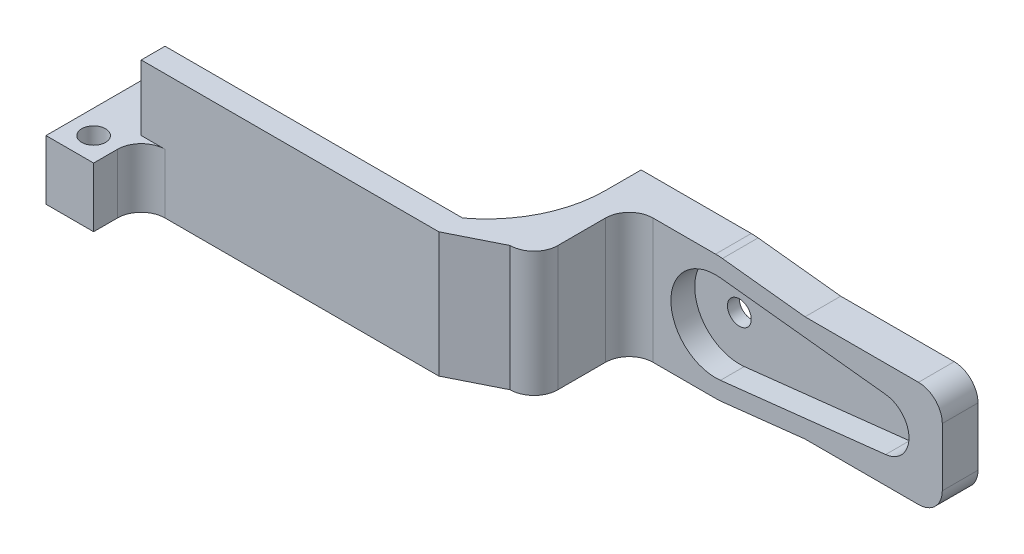
ISO-10303-21;
HEADER;
FILE_DESCRIPTION(('STEP AP214'),'2;1');
FILE_NAME('part.step','',(''),(''),'','','');
FILE_SCHEMA(('AUTOMOTIVE_DESIGN { 1 0 10303 214 1 1 1 1 }'));
ENDSEC;
DATA;
#1=APPLICATION_CONTEXT('core data for automotive mechanical design processes');
#2=APPLICATION_PROTOCOL_DEFINITION('international standard','automotive_design',2000,#1);
#3=PRODUCT_CONTEXT('',#1,'mechanical');
#4=PRODUCT('Part','Part','',(#3));
#5=PRODUCT_RELATED_PRODUCT_CATEGORY('part','',(#4));
#6=PRODUCT_DEFINITION_FORMATION('','',#4);
#7=PRODUCT_DEFINITION_CONTEXT('part definition',#1,'design');
#8=PRODUCT_DEFINITION('design','',#6,#7);
#9=PRODUCT_DEFINITION_SHAPE('','',#8);
#10=(LENGTH_UNIT() NAMED_UNIT(*) SI_UNIT(.MILLI.,.METRE.));
#11=(NAMED_UNIT(*) PLANE_ANGLE_UNIT() SI_UNIT($,.RADIAN.));
#12=(NAMED_UNIT(*) SI_UNIT($,.STERADIAN.) SOLID_ANGLE_UNIT());
#13=UNCERTAINTY_MEASURE_WITH_UNIT(LENGTH_MEASURE(1.E-05),#10,'distance_accuracy_value','');
#14=(GEOMETRIC_REPRESENTATION_CONTEXT(3) GLOBAL_UNCERTAINTY_ASSIGNED_CONTEXT((#13)) GLOBAL_UNIT_ASSIGNED_CONTEXT((#10,
#11,#12)) REPRESENTATION_CONTEXT('',''));
#15=CARTESIAN_POINT('',(0.,0.,0.));
#16=DIRECTION('',(0.,0.,1.));
#17=DIRECTION('',(1.,0.,0.));
#18=AXIS2_PLACEMENT_3D('',#15,#16,#17);
#19=CARTESIAN_POINT('',(-38.25,30.3298724079689,7.99999999999999));
#20=DIRECTION('',(-1.,0.,0.));
#21=DIRECTION('',(0.,0.,1.));
#22=AXIS2_PLACEMENT_3D('',#19,#20,#21);
#23=PLANE('',#22);
#24=DIRECTION('',(0.,-1.,0.));
#25=VECTOR('',#24,1.);
#26=CARTESIAN_POINT('',(-38.25,30.3298724079689,7.99999999999999));
#27=LINE('',#26,#25);
#28=CARTESIAN_POINT('',(-38.25,5.25,7.99999999999999));
#29=VERTEX_POINT('',#28);
#30=CARTESIAN_POINT('',(-38.25,-0.25,7.99999999999999));
#31=VERTEX_POINT('',#30);
#32=EDGE_CURVE('E309',#29,#31,#27,.T.);
#33=ORIENTED_EDGE('',*,*,#32,.T.);
#34=DIRECTION('',(0.,0.,1.));
#35=VECTOR('',#34,1.);
#36=CARTESIAN_POINT('',(-38.25,-0.25,14.));
#37=LINE('',#36,#35);
#38=CARTESIAN_POINT('',(-38.25,-0.25,9.99999999999999));
#39=VERTEX_POINT('',#38);
#40=EDGE_CURVE('E259',#31,#39,#37,.T.);
#41=ORIENTED_EDGE('',*,*,#40,.T.);
#42=DIRECTION('',(0.,-1.,0.));
#43=VECTOR('',#42,1.);
#44=CARTESIAN_POINT('',(-38.25,30.3298724079689,9.99999999999999));
#45=LINE('',#44,#43);
#46=CARTESIAN_POINT('',(-38.25,5.25,9.99999999999999));
#47=VERTEX_POINT('',#46);
#48=EDGE_CURVE('E305',#47,#39,#45,.T.);
#49=ORIENTED_EDGE('',*,*,#48,.F.);
#50=DIRECTION('',(0.,0.,-1.));
#51=VECTOR('',#50,1.);
#52=CARTESIAN_POINT('',(-38.25,5.25,7.99999999999999));
#53=LINE('',#52,#51);
#54=EDGE_CURVE('E310',#47,#29,#53,.T.);
#55=ORIENTED_EDGE('',*,*,#54,.T.);
#56=EDGE_LOOP('',(#33,#41,#49,#55));
#57=FACE_BOUND('',#56,.T.);
#58=ADVANCED_FACE('F35',(#57),#23,.T.);
#59=CARTESIAN_POINT('',(0.,0.,2.));
#60=DIRECTION('',(0.,0.,-1.));
#61=DIRECTION('',(-1.,0.,0.));
#62=AXIS2_PLACEMENT_3D('',#59,#60,#61);
#63=CYLINDRICAL_SURFACE('',#62,5.25);
#64=CARTESIAN_POINT('',(0.,0.,-3.));
#65=DIRECTION('',(0.,0.,1.));
#66=DIRECTION('',(1.,0.,0.));
#67=AXIS2_PLACEMENT_3D('',#64,#65,#66);
#68=CIRCLE('',#67,5.25);
#69=CARTESIAN_POINT('',(0.57918149466192,5.21795446475352,-3.));
#70=VERTEX_POINT('',#69);
#71=CARTESIAN_POINT('',(0.,5.25,-3.));
#72=VERTEX_POINT('',#71);
#73=EDGE_CURVE('E409',#70,#72,#68,.T.);
#74=ORIENTED_EDGE('',*,*,#73,.T.);
#75=DIRECTION('',(0.,0.,1.));
#76=VECTOR('',#75,1.);
#77=CARTESIAN_POINT('',(0.,5.25,-3.00000000000001));
#78=LINE('',#77,#76);
#79=CARTESIAN_POINT('',(0.,5.25,0.));
#80=VERTEX_POINT('',#79);
#81=EDGE_CURVE('E363',#72,#80,#78,.T.);
#82=ORIENTED_EDGE('',*,*,#81,.T.);
#83=CARTESIAN_POINT('',(0.,0.,0.));
#84=DIRECTION('',(0.,0.,-1.));
#85=DIRECTION('',(-1.,0.,0.));
#86=AXIS2_PLACEMENT_3D('',#83,#84,#85);
#87=CIRCLE('',#86,5.25);
#88=CARTESIAN_POINT('',(0.57918149466192,5.21795446475352,0.));
#89=VERTEX_POINT('',#88);
#90=EDGE_CURVE('E383',#80,#89,#87,.T.);
#91=ORIENTED_EDGE('',*,*,#90,.T.);
#92=DIRECTION('',(0.,0.,-1.));
#93=VECTOR('',#92,1.);
#94=CARTESIAN_POINT('',(0.57918149466192,5.21795446475352,2.));
#95=LINE('',#94,#93);
#96=EDGE_CURVE('E441',#89,#70,#95,.T.);
#97=ORIENTED_EDGE('',*,*,#96,.T.);
#98=EDGE_LOOP('',(#74,#82,#91,#97));
#99=FACE_BOUND('',#98,.T.);
#100=ADVANCED_FACE('F527',(#99),#63,.T.);
#101=CARTESIAN_POINT('',(14.4581850533808,3.67741552754058,2.));
#102=DIRECTION('',(-0.110320284697509,-0.99389608852448,0.));
#103=DIRECTION('',(0.99389608852448,-0.110320284697509,0.));
#104=AXIS2_PLACEMENT_3D('',#101,#102,#103);
#105=PLANE('',#104);
#106=DIRECTION('',(-0.99389608852448,0.110320284697509,0.));
#107=VECTOR('',#106,1.);
#108=CARTESIAN_POINT('',(14.4581850533808,3.67741552754058,0.));
#109=LINE('',#108,#107);
#110=CARTESIAN_POINT('',(7.51868327402135,4.44768499614705,0.));
#111=VERTEX_POINT('',#110);
#112=EDGE_CURVE('E370',#111,#89,#109,.T.);
#113=ORIENTED_EDGE('',*,*,#112,.F.);
#114=DIRECTION('',(0.,0.,-1.));
#115=VECTOR('',#114,1.);
#116=CARTESIAN_POINT('',(7.51868327402135,4.44768499614705,3.));
#117=LINE('',#116,#115);
#118=CARTESIAN_POINT('',(7.51868327402135,4.44768499614705,-3.));
#119=VERTEX_POINT('',#118);
#120=EDGE_CURVE('E427',#111,#119,#117,.T.);
#121=ORIENTED_EDGE('',*,*,#120,.T.);
#122=DIRECTION('',(-0.99389608852448,0.110320284697509,0.));
#123=VECTOR('',#122,1.);
#124=CARTESIAN_POINT('',(14.4581850533808,3.67741552754058,-3.));
#125=LINE('',#124,#123);
#126=EDGE_CURVE('E403',#119,#70,#125,.T.);
#127=ORIENTED_EDGE('',*,*,#126,.T.);
#128=ORIENTED_EDGE('',*,*,#96,.F.);
#129=EDGE_LOOP('',(#113,#121,#127,#128));
#130=FACE_BOUND('',#129,.T.);
#131=ADVANCED_FACE('F520',(#130),#105,.F.);
#132=CARTESIAN_POINT('',(0.579181494661921,-5.21795446475352,0.));
#133=VERTEX_POINT('',#132);
#134=CARTESIAN_POINT('',(0.,-5.25,0.));
#135=VERTEX_POINT('',#134);
#136=EDGE_CURVE('E384',#133,#135,#87,.T.);
#137=ORIENTED_EDGE('',*,*,#136,.T.);
#138=DIRECTION('',(0.,0.,1.));
#139=VECTOR('',#138,1.);
#140=CARTESIAN_POINT('',(0.,-5.25,-3.00000000000001));
#141=LINE('',#140,#139);
#142=CARTESIAN_POINT('',(0.,-5.25,-3.));
#143=VERTEX_POINT('',#142);
#144=EDGE_CURVE('E362',#143,#135,#141,.T.);
#145=ORIENTED_EDGE('',*,*,#144,.F.);
#146=CARTESIAN_POINT('',(0.579181494661922,-5.21795446475352,-3.));
#147=VERTEX_POINT('',#146);
#148=EDGE_CURVE('E408',#143,#147,#68,.T.);
#149=ORIENTED_EDGE('',*,*,#148,.T.);
#150=DIRECTION('',(0.,0.,-1.));
#151=VECTOR('',#150,1.);
#152=CARTESIAN_POINT('',(0.579181494661921,-5.21795446475352,2.));
#153=LINE('',#152,#151);
#154=EDGE_CURVE('E438',#133,#147,#153,.T.);
#155=ORIENTED_EDGE('',*,*,#154,.F.);
#156=EDGE_LOOP('',(#137,#145,#149,#155));
#157=FACE_BOUND('',#156,.T.);
#158=ADVANCED_FACE('F579',(#157),#63,.T.);
#159=CARTESIAN_POINT('',(14.4581850533808,-3.67741552754058,2.));
#160=DIRECTION('',(-0.110320284697509,0.99389608852448,0.));
#161=DIRECTION('',(-0.99389608852448,-0.110320284697509,0.));
#162=AXIS2_PLACEMENT_3D('',#159,#160,#161);
#163=PLANE('',#162);
#164=DIRECTION('',(0.,0.,-1.));
#165=VECTOR('',#164,1.);
#166=CARTESIAN_POINT('',(7.51868327402135,-4.44768499614705,3.));
#167=LINE('',#166,#165);
#168=CARTESIAN_POINT('',(7.51868327402134,-4.44768499614705,0.));
#169=VERTEX_POINT('',#168);
#170=CARTESIAN_POINT('',(7.51868327402134,-4.44768499614705,-3.));
#171=VERTEX_POINT('',#170);
#172=EDGE_CURVE('E426',#169,#171,#167,.T.);
#173=ORIENTED_EDGE('',*,*,#172,.F.);
#174=DIRECTION('',(-0.99389608852448,-0.110320284697509,0.));
#175=VECTOR('',#174,1.);
#176=CARTESIAN_POINT('',(14.4581850533808,-3.67741552754058,0.));
#177=LINE('',#176,#175);
#178=EDGE_CURVE('E380',#169,#133,#177,.T.);
#179=ORIENTED_EDGE('',*,*,#178,.T.);
#180=ORIENTED_EDGE('',*,*,#154,.T.);
#181=DIRECTION('',(0.99389608852448,0.110320284697509,0.));
#182=VECTOR('',#181,1.);
#183=CARTESIAN_POINT('',(14.4581850533808,-3.67741552754058,-3.));
#184=LINE('',#183,#182);
#185=EDGE_CURVE('E411',#147,#171,#184,.T.);
#186=ORIENTED_EDGE('',*,*,#185,.T.);
#187=EDGE_LOOP('',(#173,#179,#180,#186));
#188=FACE_BOUND('',#187,.T.);
#189=ADVANCED_FACE('F582',(#188),#163,.F.);
#190=CARTESIAN_POINT('',(0.,0.,2.));
#191=DIRECTION('',(0.,0.,-1.));
#192=DIRECTION('',(-1.,0.,0.));
#193=AXIS2_PLACEMENT_3D('',#190,#191,#192);
#194=CYLINDRICAL_SURFACE('',#193,3.75);
#195=CARTESIAN_POINT('',(0.,0.,0.));
#196=DIRECTION('',(0.,0.,-1.));
#197=DIRECTION('',(-1.,0.,0.));
#198=AXIS2_PLACEMENT_3D('',#195,#196,#197);
#199=CIRCLE('',#198,3.75);
#200=CARTESIAN_POINT('',(0.413701067615659,-3.7271103319668,0.));
#201=VERTEX_POINT('',#200);
#202=CARTESIAN_POINT('',(0.413701067615659,3.7271103319668,0.));
#203=VERTEX_POINT('',#202);
#204=EDGE_CURVE('E392',#201,#203,#199,.T.);
#205=ORIENTED_EDGE('',*,*,#204,.F.);
#206=DIRECTION('',(0.,0.,-1.));
#207=VECTOR('',#206,1.);
#208=CARTESIAN_POINT('',(0.413701067615658,-3.7271103319668,2.));
#209=LINE('',#208,#207);
#210=CARTESIAN_POINT('',(0.413701067615659,-3.7271103319668,-2.));
#211=VERTEX_POINT('',#210);
#212=EDGE_CURVE('E436',#201,#211,#209,.T.);
#213=ORIENTED_EDGE('',*,*,#212,.T.);
#214=CARTESIAN_POINT('',(0.,0.,-2.));
#215=DIRECTION('',(0.,0.,1.));
#216=DIRECTION('',(1.,0.,0.));
#217=AXIS2_PLACEMENT_3D('',#214,#215,#216);
#218=CIRCLE('',#217,3.75);
#219=CARTESIAN_POINT('',(0.413701067615659,3.7271103319668,-2.));
#220=VERTEX_POINT('',#219);
#221=EDGE_CURVE('E414',#220,#211,#218,.T.);
#222=ORIENTED_EDGE('',*,*,#221,.F.);
#223=DIRECTION('',(0.,0.,-1.));
#224=VECTOR('',#223,1.);
#225=CARTESIAN_POINT('',(0.413701067615659,3.7271103319668,2.));
#226=LINE('',#225,#224);
#227=EDGE_CURVE('E429',#203,#220,#226,.T.);
#228=ORIENTED_EDGE('',*,*,#227,.F.);
#229=EDGE_LOOP('',(#205,#213,#222,#228));
#230=FACE_BOUND('',#229,.T.);
#231=ADVANCED_FACE('F584',(#230),#194,.F.);
#232=CARTESIAN_POINT('',(14.2927046263345,-2.18657139475386,2.));
#233=DIRECTION('',(-0.110320284697509,0.99389608852448,0.));
#234=DIRECTION('',(-0.99389608852448,-0.110320284697509,0.));
#235=AXIS2_PLACEMENT_3D('',#232,#233,#234);
#236=PLANE('',#235);
#237=DIRECTION('',(-0.99389608852448,-0.110320284697509,0.));
#238=VECTOR('',#237,1.);
#239=CARTESIAN_POINT('',(14.2927046263345,-2.18657139475386,0.));
#240=LINE('',#239,#238);
#241=CARTESIAN_POINT('',(14.2927046263345,-2.18657139475386,0.));
#242=VERTEX_POINT('',#241);
#243=EDGE_CURVE('E390',#242,#201,#240,.T.);
#244=ORIENTED_EDGE('',*,*,#243,.F.);
#245=DIRECTION('',(0.,0.,-1.));
#246=VECTOR('',#245,1.);
#247=CARTESIAN_POINT('',(14.2927046263345,-2.18657139475386,2.));
#248=LINE('',#247,#246);
#249=CARTESIAN_POINT('',(14.2927046263345,-2.18657139475386,-2.));
#250=VERTEX_POINT('',#249);
#251=EDGE_CURVE('E434',#242,#250,#248,.T.);
#252=ORIENTED_EDGE('',*,*,#251,.T.);
#253=DIRECTION('',(0.99389608852448,0.110320284697509,0.));
#254=VECTOR('',#253,1.);
#255=CARTESIAN_POINT('',(14.2927046263345,-2.18657139475386,-2.));
#256=LINE('',#255,#254);
#257=EDGE_CURVE('E417',#211,#250,#256,.T.);
#258=ORIENTED_EDGE('',*,*,#257,.F.);
#259=ORIENTED_EDGE('',*,*,#212,.F.);
#260=EDGE_LOOP('',(#244,#252,#258,#259));
#261=FACE_BOUND('',#260,.T.);
#262=ADVANCED_FACE('F590',(#261),#236,.T.);
#263=CARTESIAN_POINT('',(14.05,0.,2.));
#264=DIRECTION('',(0.,0.,-1.));
#265=DIRECTION('',(-1.,0.,0.));
#266=AXIS2_PLACEMENT_3D('',#263,#264,#265);
#267=CYLINDRICAL_SURFACE('',#266,2.2);
#268=CARTESIAN_POINT('',(14.05,0.,0.));
#269=DIRECTION('',(0.,0.,-1.));
#270=DIRECTION('',(-1.,0.,0.));
#271=AXIS2_PLACEMENT_3D('',#268,#269,#270);
#272=CIRCLE('',#271,2.2);
#273=CARTESIAN_POINT('',(14.2927046263345,2.18657139475386,0.));
#274=VERTEX_POINT('',#273);
#275=EDGE_CURVE('E388',#274,#242,#272,.T.);
#276=ORIENTED_EDGE('',*,*,#275,.F.);
#277=DIRECTION('',(0.,0.,-1.));
#278=VECTOR('',#277,1.);
#279=CARTESIAN_POINT('',(14.2927046263345,2.18657139475386,2.));
#280=LINE('',#279,#278);
#281=CARTESIAN_POINT('',(14.2927046263345,2.18657139475386,-2.));
#282=VERTEX_POINT('',#281);
#283=EDGE_CURVE('E432',#274,#282,#280,.T.);
#284=ORIENTED_EDGE('',*,*,#283,.T.);
#285=CARTESIAN_POINT('',(14.05,0.,-2.));
#286=DIRECTION('',(0.,0.,1.));
#287=DIRECTION('',(1.,0.,0.));
#288=AXIS2_PLACEMENT_3D('',#285,#286,#287);
#289=CIRCLE('',#288,2.2);
#290=EDGE_CURVE('E420',#250,#282,#289,.T.);
#291=ORIENTED_EDGE('',*,*,#290,.F.);
#292=ORIENTED_EDGE('',*,*,#251,.F.);
#293=EDGE_LOOP('',(#276,#284,#291,#292));
#294=FACE_BOUND('',#293,.T.);
#295=ADVANCED_FACE('F639',(#294),#267,.F.);
#296=CARTESIAN_POINT('',(14.2927046263345,2.18657139475386,2.));
#297=DIRECTION('',(-0.110320284697509,-0.99389608852448,0.));
#298=DIRECTION('',(0.99389608852448,-0.110320284697509,0.));
#299=AXIS2_PLACEMENT_3D('',#296,#297,#298);
#300=PLANE('',#299);
#301=DIRECTION('',(0.99389608852448,-0.110320284697509,0.));
#302=VECTOR('',#301,1.);
#303=CARTESIAN_POINT('',(14.2927046263345,2.18657139475386,0.));
#304=LINE('',#303,#302);
#305=EDGE_CURVE('E386',#203,#274,#304,.T.);
#306=ORIENTED_EDGE('',*,*,#305,.F.);
#307=ORIENTED_EDGE('',*,*,#227,.T.);
#308=DIRECTION('',(-0.99389608852448,0.110320284697509,0.));
#309=VECTOR('',#308,1.);
#310=CARTESIAN_POINT('',(14.2927046263345,2.18657139475386,-2.));
#311=LINE('',#310,#309);
#312=EDGE_CURVE('E423',#282,#220,#311,.T.);
#313=ORIENTED_EDGE('',*,*,#312,.F.);
#314=ORIENTED_EDGE('',*,*,#283,.F.);
#315=EDGE_LOOP('',(#306,#307,#313,#314));
#316=FACE_BOUND('',#315,.T.);
#317=ADVANCED_FACE('F636',(#316),#300,.T.);
#318=CARTESIAN_POINT('',(0.,4.44768499614705,3.));
#319=DIRECTION('',(0.,1.,0.));
#320=DIRECTION('',(-1.,0.,0.));
#321=AXIS2_PLACEMENT_3D('',#318,#319,#320);
#322=PLANE('',#321);
#323=DIRECTION('',(-1.,0.,0.));
#324=VECTOR('',#323,1.);
#325=CARTESIAN_POINT('',(-7.35780761192771,4.44768499614705,0.));
#326=LINE('',#325,#324);
#327=CARTESIAN_POINT('',(17.05,4.44768499614705,0.));
#328=VERTEX_POINT('',#327);
#329=EDGE_CURVE('E373',#328,#111,#326,.T.);
#330=ORIENTED_EDGE('',*,*,#329,.F.);
#331=DIRECTION('',(0.,0.,1.));
#332=VECTOR('',#331,1.);
#333=CARTESIAN_POINT('',(17.05,4.44768499614705,-3.));
#334=LINE('',#333,#332);
#335=CARTESIAN_POINT('',(17.05,4.44768499614705,-3.));
#336=VERTEX_POINT('',#335);
#337=EDGE_CURVE('E11',#328,#336,#334,.F.);
#338=ORIENTED_EDGE('',*,*,#337,.T.);
#339=DIRECTION('',(1.,0.,0.));
#340=VECTOR('',#339,1.);
#341=CARTESIAN_POINT('',(0.,4.44768499614705,-3.));
#342=LINE('',#341,#340);
#343=EDGE_CURVE('E394',#119,#336,#342,.T.);
#344=ORIENTED_EDGE('',*,*,#343,.F.);
#345=ORIENTED_EDGE('',*,*,#120,.F.);
#346=EDGE_LOOP('',(#330,#338,#344,#345));
#347=FACE_BOUND('',#346,.T.);
#348=ADVANCED_FACE('F517',(#347),#322,.T.);
#349=CARTESIAN_POINT('',(0.,-4.44768499614705,3.));
#350=DIRECTION('',(0.,1.,0.));
#351=DIRECTION('',(-1.,0.,0.));
#352=AXIS2_PLACEMENT_3D('',#349,#350,#351);
#353=PLANE('',#352);
#354=DIRECTION('',(1.,0.,0.));
#355=VECTOR('',#354,1.);
#356=CARTESIAN_POINT('',(0.,-4.44768499614705,-3.));
#357=LINE('',#356,#355);
#358=CARTESIAN_POINT('',(17.05,-4.44768499614705,-3.));
#359=VERTEX_POINT('',#358);
#360=EDGE_CURVE('E396',#171,#359,#357,.T.);
#361=ORIENTED_EDGE('',*,*,#360,.T.);
#362=DIRECTION('',(0.,0.,1.));
#363=VECTOR('',#362,1.);
#364=CARTESIAN_POINT('',(17.05,-4.44768499614705,3.));
#365=LINE('',#364,#363);
#366=CARTESIAN_POINT('',(17.05,-4.44768499614705,0.));
#367=VERTEX_POINT('',#366);
#368=EDGE_CURVE('E481',#359,#367,#365,.T.);
#369=ORIENTED_EDGE('',*,*,#368,.T.);
#370=DIRECTION('',(-1.,0.,0.));
#371=VECTOR('',#370,1.);
#372=CARTESIAN_POINT('',(0.,-4.44768499614705,0.));
#373=LINE('',#372,#371);
#374=EDGE_CURVE('E378',#367,#169,#373,.T.);
#375=ORIENTED_EDGE('',*,*,#374,.T.);
#376=ORIENTED_EDGE('',*,*,#172,.T.);
#377=EDGE_LOOP('',(#361,#369,#375,#376));
#378=FACE_BOUND('',#377,.T.);
#379=ADVANCED_FACE('F502',(#378),#353,.F.);
#380=CARTESIAN_POINT('',(0.,0.,-2.));
#381=DIRECTION('',(0.,0.,-1.));
#382=DIRECTION('',(1.,0.,0.));
#383=AXIS2_PLACEMENT_3D('',#380,#381,#382);
#384=CYLINDRICAL_SURFACE('',#383,1.);
#385=CARTESIAN_POINT('',(0.,0.,-2.));
#386=DIRECTION('',(0.,0.,1.));
#387=DIRECTION('',(1.,0.,0.));
#388=AXIS2_PLACEMENT_3D('',#385,#386,#387);
#389=CIRCLE('',#388,1.);
#390=CARTESIAN_POINT('',(1.,0.,-2.));
#391=VERTEX_POINT('',#390);
#392=EDGE_CURVE('E400',#391,#391,#389,.T.);
#393=ORIENTED_EDGE('',*,*,#392,.T.);
#394=EDGE_LOOP('',(#393));
#395=FACE_BOUND('',#394,.T.);
#396=CARTESIAN_POINT('',(0.,0.,-3.));
#397=DIRECTION('',(0.,0.,1.));
#398=DIRECTION('',(1.,0.,0.));
#399=AXIS2_PLACEMENT_3D('',#396,#397,#398);
#400=CIRCLE('',#399,1.);
#401=CARTESIAN_POINT('',(1.,0.,-3.));
#402=VERTEX_POINT('',#401);
#403=EDGE_CURVE('E399',#402,#402,#400,.T.);
#404=ORIENTED_EDGE('',*,*,#403,.F.);
#405=EDGE_LOOP('',(#404));
#406=FACE_BOUND('',#405,.T.);
#407=ADVANCED_FACE('F622',(#395,#406),#384,.F.);
#408=CARTESIAN_POINT('',(14.05,0.,-3.));
#409=DIRECTION('',(0.,0.,-1.));
#410=DIRECTION('',(1.,0.,0.));
#411=AXIS2_PLACEMENT_3D('',#408,#409,#410);
#412=PLANE('',#411);
#413=DIRECTION('',(0.,1.,0.));
#414=VECTOR('',#413,1.);
#415=CARTESIAN_POINT('',(19.05,0.,-3.));
#416=LINE('',#415,#414);
#417=CARTESIAN_POINT('',(19.05,-2.44768499614705,-3.));
#418=VERTEX_POINT('',#417);
#419=CARTESIAN_POINT('',(19.05,2.44768499614705,-3.));
#420=VERTEX_POINT('',#419);
#421=EDGE_CURVE('E366',#418,#420,#416,.T.);
#422=ORIENTED_EDGE('',*,*,#421,.F.);
#423=CARTESIAN_POINT('',(17.05,-2.44768499614705,-3.));
#424=DIRECTION('',(0.,0.,-1.));
#425=DIRECTION('',(-1.,0.,0.));
#426=AXIS2_PLACEMENT_3D('',#423,#424,#425);
#427=CIRCLE('',#426,2.);
#428=EDGE_CURVE('E43',#418,#359,#427,.T.);
#429=ORIENTED_EDGE('',*,*,#428,.T.);
#430=ORIENTED_EDGE('',*,*,#360,.F.);
#431=ORIENTED_EDGE('',*,*,#185,.F.);
#432=ORIENTED_EDGE('',*,*,#148,.F.);
#433=DIRECTION('',(1.,0.,0.));
#434=VECTOR('',#433,1.);
#435=CARTESIAN_POINT('',(-7.25,-5.25,-3.00000000000001));
#436=LINE('',#435,#434);
#437=CARTESIAN_POINT('',(-9.25,-5.25,-3.));
#438=VERTEX_POINT('',#437);
#439=EDGE_CURVE('E357',#438,#143,#436,.T.);
#440=ORIENTED_EDGE('',*,*,#439,.F.);
#441=DIRECTION('',(0.,-1.,0.));
#442=VECTOR('',#441,1.);
#443=CARTESIAN_POINT('',(-9.25,5.25,-3.));
#444=LINE('',#443,#442);
#445=CARTESIAN_POINT('',(-9.25,5.25,-3.));
#446=VERTEX_POINT('',#445);
#447=EDGE_CURVE('E331',#446,#438,#444,.T.);
#448=ORIENTED_EDGE('',*,*,#447,.F.);
#449=DIRECTION('',(-1.,0.,0.));
#450=VECTOR('',#449,1.);
#451=CARTESIAN_POINT('',(-7.25,5.25,-3.00000000000001));
#452=LINE('',#451,#450);
#453=EDGE_CURVE('E360',#72,#446,#452,.T.);
#454=ORIENTED_EDGE('',*,*,#453,.F.);
#455=ORIENTED_EDGE('',*,*,#73,.F.);
#456=ORIENTED_EDGE('',*,*,#126,.F.);
#457=ORIENTED_EDGE('',*,*,#343,.T.);
#458=CARTESIAN_POINT('',(17.05,2.44768499614705,-3.));
#459=DIRECTION('',(0.,0.,-1.));
#460=DIRECTION('',(-1.,0.,0.));
#461=AXIS2_PLACEMENT_3D('',#458,#459,#460);
#462=CIRCLE('',#461,2.);
#463=EDGE_CURVE('E55',#336,#420,#462,.T.);
#464=ORIENTED_EDGE('',*,*,#463,.T.);
#465=EDGE_LOOP('',(#422,#429,#430,#431,#432,#440,#448,#454,#455,#456,#457,#464));
#466=FACE_BOUND('',#465,.T.);
#467=ORIENTED_EDGE('',*,*,#403,.T.);
#468=EDGE_LOOP('',(#467));
#469=FACE_BOUND('',#468,.T.);
#470=ADVANCED_FACE('F495',(#466,#469),#412,.T.);
#471=CARTESIAN_POINT('',(14.05,0.,-2.));
#472=DIRECTION('',(0.,0.,-1.));
#473=DIRECTION('',(1.,0.,0.));
#474=AXIS2_PLACEMENT_3D('',#471,#472,#473);
#475=PLANE('',#474);
#476=ORIENTED_EDGE('',*,*,#392,.F.);
#477=EDGE_LOOP('',(#476));
#478=FACE_BOUND('',#477,.T.);
#479=ORIENTED_EDGE('',*,*,#221,.T.);
#480=ORIENTED_EDGE('',*,*,#257,.T.);
#481=ORIENTED_EDGE('',*,*,#290,.T.);
#482=ORIENTED_EDGE('',*,*,#312,.T.);
#483=EDGE_LOOP('',(#479,#480,#481,#482));
#484=FACE_BOUND('',#483,.T.);
#485=ADVANCED_FACE('F621',(#478,#484),#475,.F.);
#486=CARTESIAN_POINT('',(-7.35780761192771,-33.552315003853,0.));
#487=DIRECTION('',(0.,0.,-1.));
#488=DIRECTION('',(-1.,0.,0.));
#489=AXIS2_PLACEMENT_3D('',#486,#487,#488);
#490=PLANE('',#489);
#491=ORIENTED_EDGE('',*,*,#374,.F.);
#492=CARTESIAN_POINT('',(17.05,-2.44768499614705,0.));
#493=DIRECTION('',(0.,0.,-1.));
#494=DIRECTION('',(-1.,0.,0.));
#495=AXIS2_PLACEMENT_3D('',#492,#493,#494);
#496=CIRCLE('',#495,2.);
#497=CARTESIAN_POINT('',(19.05,-2.44768499614705,0.));
#498=VERTEX_POINT('',#497);
#499=EDGE_CURVE('E486',#367,#498,#496,.F.);
#500=ORIENTED_EDGE('',*,*,#499,.T.);
#501=DIRECTION('',(0.,-1.,0.));
#502=VECTOR('',#501,1.);
#503=CARTESIAN_POINT('',(19.05,2.44768499614703,0.));
#504=LINE('',#503,#502);
#505=CARTESIAN_POINT('',(19.05,2.44768499614705,0.));
#506=VERTEX_POINT('',#505);
#507=EDGE_CURVE('E375',#506,#498,#504,.T.);
#508=ORIENTED_EDGE('',*,*,#507,.F.);
#509=CARTESIAN_POINT('',(17.05,2.44768499614705,0.));
#510=DIRECTION('',(0.,0.,-1.));
#511=DIRECTION('',(-1.,0.,0.));
#512=AXIS2_PLACEMENT_3D('',#509,#510,#511);
#513=CIRCLE('',#512,2.);
#514=EDGE_CURVE('E484',#506,#328,#513,.F.);
#515=ORIENTED_EDGE('',*,*,#514,.T.);
#516=ORIENTED_EDGE('',*,*,#329,.T.);
#517=ORIENTED_EDGE('',*,*,#112,.T.);
#518=ORIENTED_EDGE('',*,*,#90,.F.);
#519=DIRECTION('',(1.,0.,0.));
#520=VECTOR('',#519,1.);
#521=CARTESIAN_POINT('',(-7.25,5.25,0.));
#522=LINE('',#521,#520);
#523=CARTESIAN_POINT('',(-5.25,5.25,0.));
#524=VERTEX_POINT('',#523);
#525=EDGE_CURVE('E353',#524,#80,#522,.T.);
#526=ORIENTED_EDGE('',*,*,#525,.F.);
#527=DIRECTION('',(0.,-1.,0.));
#528=VECTOR('',#527,1.);
#529=CARTESIAN_POINT('',(-5.25,-33.552315003853,0.));
#530=LINE('',#529,#528);
#531=CARTESIAN_POINT('',(-5.25,-5.25,0.));
#532=VERTEX_POINT('',#531);
#533=EDGE_CURVE('E443',#524,#532,#530,.T.);
#534=ORIENTED_EDGE('',*,*,#533,.T.);
#535=DIRECTION('',(-1.,0.,0.));
#536=VECTOR('',#535,1.);
#537=CARTESIAN_POINT('',(-7.25,-5.25,0.));
#538=LINE('',#537,#536);
#539=EDGE_CURVE('E354',#135,#532,#538,.T.);
#540=ORIENTED_EDGE('',*,*,#539,.F.);
#541=ORIENTED_EDGE('',*,*,#136,.F.);
#542=ORIENTED_EDGE('',*,*,#178,.F.);
#543=EDGE_LOOP('',(#491,#500,#508,#515,#516,#517,#518,#526,#534,#540,#541,#542));
#544=FACE_BOUND('',#543,.T.);
#545=ORIENTED_EDGE('',*,*,#204,.T.);
#546=ORIENTED_EDGE('',*,*,#305,.T.);
#547=ORIENTED_EDGE('',*,*,#275,.T.);
#548=ORIENTED_EDGE('',*,*,#243,.T.);
#549=EDGE_LOOP('',(#545,#546,#547,#548));
#550=FACE_BOUND('',#549,.T.);
#551=ADVANCED_FACE('F508',(#544,#550),#490,.F.);
#552=CARTESIAN_POINT('',(19.05,2.44768499614703,1.5));
#553=DIRECTION('',(-1.,0.,0.));
#554=DIRECTION('',(0.,0.,1.));
#555=AXIS2_PLACEMENT_3D('',#552,#553,#554);
#556=PLANE('',#555);
#557=ORIENTED_EDGE('',*,*,#507,.T.);
#558=DIRECTION('',(0.,0.,1.));
#559=VECTOR('',#558,1.);
#560=CARTESIAN_POINT('',(19.05,-2.44768499614705,1.5));
#561=LINE('',#560,#559);
#562=EDGE_CURVE('E491',#498,#418,#561,.F.);
#563=ORIENTED_EDGE('',*,*,#562,.T.);
#564=ORIENTED_EDGE('',*,*,#421,.T.);
#565=DIRECTION('',(0.,0.,1.));
#566=VECTOR('',#565,1.);
#567=CARTESIAN_POINT('',(19.05,2.44768499614705,0.));
#568=LINE('',#567,#566);
#569=EDGE_CURVE('E488',#420,#506,#568,.T.);
#570=ORIENTED_EDGE('',*,*,#569,.T.);
#571=EDGE_LOOP('',(#557,#563,#564,#570));
#572=FACE_BOUND('',#571,.T.);
#573=ADVANCED_FACE('F512',(#572),#556,.F.);
#574=CARTESIAN_POINT('',(-7.25,5.25,-3.00000000000001));
#575=DIRECTION('',(0.,1.,0.));
#576=DIRECTION('',(0.,0.,1.));
#577=AXIS2_PLACEMENT_3D('',#574,#575,#576);
#578=PLANE('',#577);
#579=DIRECTION('',(-0.894427190999916,0.,0.447213595499957));
#580=VECTOR('',#579,1.);
#581=CARTESIAN_POINT('',(-9.25,5.25,8.));
#582=LINE('',#581,#580);
#583=CARTESIAN_POINT('',(-9.25,5.25,8.));
#584=VERTEX_POINT('',#583);
#585=CARTESIAN_POINT('',(-13.25,5.25,9.99999999999999));
#586=VERTEX_POINT('',#585);
#587=EDGE_CURVE('E319',#584,#586,#582,.T.);
#588=ORIENTED_EDGE('',*,*,#587,.F.);
#589=CARTESIAN_POINT('',(-9.25,5.25,6.));
#590=DIRECTION('',(0.,1.,0.));
#591=DIRECTION('',(0.,0.,1.));
#592=AXIS2_PLACEMENT_3D('',#589,#590,#591);
#593=CIRCLE('',#592,2.);
#594=CARTESIAN_POINT('',(-7.25,5.25,6.));
#595=VERTEX_POINT('',#594);
#596=EDGE_CURVE('E475',#584,#595,#593,.T.);
#597=ORIENTED_EDGE('',*,*,#596,.T.);
#598=DIRECTION('',(0.,0.,1.));
#599=VECTOR('',#598,1.);
#600=CARTESIAN_POINT('',(-7.25,5.25,-3.));
#601=LINE('',#600,#599);
#602=CARTESIAN_POINT('',(-7.25,5.25,2.));
#603=VERTEX_POINT('',#602);
#604=EDGE_CURVE('E334',#603,#595,#601,.T.);
#605=ORIENTED_EDGE('',*,*,#604,.F.);
#606=CARTESIAN_POINT('',(-5.25,5.25,2.));
#607=DIRECTION('',(0.,1.,0.));
#608=DIRECTION('',(0.,0.,1.));
#609=AXIS2_PLACEMENT_3D('',#606,#607,#608);
#610=CIRCLE('',#609,2.);
#611=EDGE_CURVE('E450',#603,#524,#610,.F.);
#612=ORIENTED_EDGE('',*,*,#611,.T.);
#613=ORIENTED_EDGE('',*,*,#525,.T.);
#614=ORIENTED_EDGE('',*,*,#81,.F.);
#615=ORIENTED_EDGE('',*,*,#453,.T.);
#616=DIRECTION('',(0.,0.,1.));
#617=VECTOR('',#616,1.);
#618=CARTESIAN_POINT('',(-9.25,5.25,-3.));
#619=LINE('',#618,#617);
#620=CARTESIAN_POINT('',(-9.25,5.25,0.));
#621=VERTEX_POINT('',#620);
#622=EDGE_CURVE('E342',#446,#621,#619,.T.);
#623=ORIENTED_EDGE('',*,*,#622,.T.);
#624=CARTESIAN_POINT('',(-19.25,5.25,0.));
#625=DIRECTION('',(0.,1.,0.));
#626=DIRECTION('',(0.,0.,1.));
#627=AXIS2_PLACEMENT_3D('',#624,#625,#626);
#628=CIRCLE('',#627,10.);
#629=CARTESIAN_POINT('',(-13.25,5.25,7.99999999999999));
#630=VERTEX_POINT('',#629);
#631=EDGE_CURVE('E350',#621,#630,#628,.F.);
#632=ORIENTED_EDGE('',*,*,#631,.T.);
#633=DIRECTION('',(1.,0.,0.));
#634=VECTOR('',#633,1.);
#635=CARTESIAN_POINT('',(-13.25,5.25,7.99999999999999));
#636=LINE('',#635,#634);
#637=EDGE_CURVE('E306',#29,#630,#636,.T.);
#638=ORIENTED_EDGE('',*,*,#637,.F.);
#639=ORIENTED_EDGE('',*,*,#54,.F.);
#640=DIRECTION('',(-1.,0.,0.));
#641=VECTOR('',#640,1.);
#642=CARTESIAN_POINT('',(-13.25,5.25,9.99999999999999));
#643=LINE('',#642,#641);
#644=EDGE_CURVE('E300',#586,#47,#643,.T.);
#645=ORIENTED_EDGE('',*,*,#644,.F.);
#646=EDGE_LOOP('',(#588,#597,#605,#612,#613,#614,#615,#623,#632,#638,#639,#645));
#647=FACE_BOUND('',#646,.T.);
#648=ADVANCED_FACE('F532',(#647),#578,.T.);
#649=CARTESIAN_POINT('',(-7.25,-5.25,-3.00000000000001));
#650=DIRECTION('',(0.,-1.,0.));
#651=DIRECTION('',(0.,0.,-1.));
#652=AXIS2_PLACEMENT_3D('',#649,#650,#651);
#653=PLANE('',#652);
#654=DIRECTION('',(0.,0.,1.));
#655=VECTOR('',#654,1.);
#656=CARTESIAN_POINT('',(-7.25,-5.25,-3.));
#657=LINE('',#656,#655);
#658=CARTESIAN_POINT('',(-7.25,-5.25,2.));
#659=VERTEX_POINT('',#658);
#660=CARTESIAN_POINT('',(-7.25,-5.25,6.));
#661=VERTEX_POINT('',#660);
#662=EDGE_CURVE('E335',#659,#661,#657,.T.);
#663=ORIENTED_EDGE('',*,*,#662,.T.);
#664=CARTESIAN_POINT('',(-9.25,-5.25,6.));
#665=DIRECTION('',(0.,-1.,0.));
#666=DIRECTION('',(0.,0.,-1.));
#667=AXIS2_PLACEMENT_3D('',#664,#665,#666);
#668=CIRCLE('',#667,2.);
#669=CARTESIAN_POINT('',(-9.25,-5.25,8.));
#670=VERTEX_POINT('',#669);
#671=EDGE_CURVE('E479',#661,#670,#668,.T.);
#672=ORIENTED_EDGE('',*,*,#671,.T.);
#673=DIRECTION('',(-0.894427190999916,0.,0.447213595499957));
#674=VECTOR('',#673,1.);
#675=CARTESIAN_POINT('',(-9.25,-5.25,8.));
#676=LINE('',#675,#674);
#677=CARTESIAN_POINT('',(-13.25,-5.25,9.99999999999999));
#678=VERTEX_POINT('',#677);
#679=EDGE_CURVE('E308',#670,#678,#676,.T.);
#680=ORIENTED_EDGE('',*,*,#679,.T.);
#681=DIRECTION('',(-1.,0.,0.));
#682=VECTOR('',#681,1.);
#683=CARTESIAN_POINT('',(-13.25,-5.25,9.99999999999999));
#684=LINE('',#683,#682);
#685=CARTESIAN_POINT('',(-36.25,-5.25,9.99999999999999));
#686=VERTEX_POINT('',#685);
#687=EDGE_CURVE('E294',#678,#686,#684,.T.);
#688=ORIENTED_EDGE('',*,*,#687,.T.);
#689=CARTESIAN_POINT('',(-36.25,-5.25,12.));
#690=DIRECTION('',(0.,-1.,0.));
#691=DIRECTION('',(0.,0.,-1.));
#692=AXIS2_PLACEMENT_3D('',#689,#690,#691);
#693=CIRCLE('',#692,2.);
#694=CARTESIAN_POINT('',(-38.25,-5.25,12.));
#695=VERTEX_POINT('',#694);
#696=EDGE_CURVE('E467',#686,#695,#693,.F.);
#697=ORIENTED_EDGE('',*,*,#696,.T.);
#698=DIRECTION('',(0.,0.,1.));
#699=VECTOR('',#698,1.);
#700=CARTESIAN_POINT('',(-38.25,-5.25,14.));
#701=LINE('',#700,#699);
#702=CARTESIAN_POINT('',(-38.25,-5.25,14.));
#703=VERTEX_POINT('',#702);
#704=EDGE_CURVE('E285',#695,#703,#701,.T.);
#705=ORIENTED_EDGE('',*,*,#704,.T.);
#706=DIRECTION('',(-1.,0.,0.));
#707=VECTOR('',#706,1.);
#708=CARTESIAN_POINT('',(-38.25,-5.25,14.));
#709=LINE('',#708,#707);
#710=CARTESIAN_POINT('',(-42.25,-5.25,14.));
#711=VERTEX_POINT('',#710);
#712=EDGE_CURVE('E265',#703,#711,#709,.T.);
#713=ORIENTED_EDGE('',*,*,#712,.T.);
#714=DIRECTION('',(0.,0.,-1.));
#715=VECTOR('',#714,1.);
#716=CARTESIAN_POINT('',(-42.25,-5.25,14.));
#717=LINE('',#716,#715);
#718=CARTESIAN_POINT('',(-42.25,-5.25,3.99999999999999));
#719=VERTEX_POINT('',#718);
#720=EDGE_CURVE('E287',#711,#719,#717,.T.);
#721=ORIENTED_EDGE('',*,*,#720,.T.);
#722=DIRECTION('',(1.,0.,0.));
#723=VECTOR('',#722,1.);
#724=CARTESIAN_POINT('',(-38.25,-5.25,3.99999999999999));
#725=LINE('',#724,#723);
#726=CARTESIAN_POINT('',(-38.25,-5.25,3.99999999999999));
#727=VERTEX_POINT('',#726);
#728=EDGE_CURVE('E257',#719,#727,#725,.T.);
#729=ORIENTED_EDGE('',*,*,#728,.T.);
#730=CARTESIAN_POINT('',(-38.25,-5.25,5.99999999999999));
#731=VERTEX_POINT('',#730);
#732=EDGE_CURVE('E282',#727,#731,#701,.T.);
#733=ORIENTED_EDGE('',*,*,#732,.T.);
#734=CARTESIAN_POINT('',(-36.25,-5.25,5.99999999999999));
#735=DIRECTION('',(0.,-1.,0.));
#736=DIRECTION('',(0.,0.,-1.));
#737=AXIS2_PLACEMENT_3D('',#734,#735,#736);
#738=CIRCLE('',#737,2.);
#739=CARTESIAN_POINT('',(-36.25,-5.25,7.99999999999999));
#740=VERTEX_POINT('',#739);
#741=EDGE_CURVE('E471',#731,#740,#738,.F.);
#742=ORIENTED_EDGE('',*,*,#741,.T.);
#743=DIRECTION('',(1.,0.,0.));
#744=VECTOR('',#743,1.);
#745=CARTESIAN_POINT('',(-13.25,-5.25,7.99999999999999));
#746=LINE('',#745,#744);
#747=CARTESIAN_POINT('',(-13.25,-5.25,7.99999999999999));
#748=VERTEX_POINT('',#747);
#749=EDGE_CURVE('E298',#740,#748,#746,.T.);
#750=ORIENTED_EDGE('',*,*,#749,.T.);
#751=CARTESIAN_POINT('',(-19.25,-5.25,0.));
#752=DIRECTION('',(0.,-1.,0.));
#753=DIRECTION('',(0.,0.,-1.));
#754=AXIS2_PLACEMENT_3D('',#751,#752,#753);
#755=CIRCLE('',#754,10.);
#756=CARTESIAN_POINT('',(-9.25,-5.25,0.));
#757=VERTEX_POINT('',#756);
#758=EDGE_CURVE('E348',#748,#757,#755,.F.);
#759=ORIENTED_EDGE('',*,*,#758,.T.);
#760=DIRECTION('',(0.,0.,1.));
#761=VECTOR('',#760,1.);
#762=CARTESIAN_POINT('',(-9.25,-5.25,-3.));
#763=LINE('',#762,#761);
#764=EDGE_CURVE('E339',#438,#757,#763,.T.);
#765=ORIENTED_EDGE('',*,*,#764,.F.);
#766=ORIENTED_EDGE('',*,*,#439,.T.);
#767=ORIENTED_EDGE('',*,*,#144,.T.);
#768=ORIENTED_EDGE('',*,*,#539,.T.);
#769=CARTESIAN_POINT('',(-5.25,-5.25,2.));
#770=DIRECTION('',(0.,-1.,0.));
#771=DIRECTION('',(0.,0.,-1.));
#772=AXIS2_PLACEMENT_3D('',#769,#770,#771);
#773=CIRCLE('',#772,2.);
#774=EDGE_CURVE('E448',#532,#659,#773,.F.);
#775=ORIENTED_EDGE('',*,*,#774,.T.);
#776=EDGE_LOOP('',(#663,#672,#680,#688,#697,#705,#713,#721,#729,#733,#742,#750,#759,#765,#766,
#767,#768,#775));
#777=FACE_BOUND('',#776,.T.);
#778=CARTESIAN_POINT('',(-40.25,-5.25,12.));
#779=DIRECTION('',(0.,-1.,0.));
#780=DIRECTION('',(0.,0.,-1.));
#781=AXIS2_PLACEMENT_3D('',#778,#779,#780);
#782=CIRCLE('',#781,0.999999999999998);
#783=CARTESIAN_POINT('',(-40.25,-5.25,11.));
#784=VERTEX_POINT('',#783);
#785=EDGE_CURVE('E1099',#784,#784,#782,.T.);
#786=ORIENTED_EDGE('',*,*,#785,.F.);
#787=EDGE_LOOP('',(#786));
#788=FACE_BOUND('',#787,.T.);
#789=CARTESIAN_POINT('',(-40.25,-5.25,5.99999999999999));
#790=DIRECTION('',(0.,-1.,0.));
#791=DIRECTION('',(0.,0.,-1.));
#792=AXIS2_PLACEMENT_3D('',#789,#790,#791);
#793=CIRCLE('',#792,0.999999999999998);
#794=CARTESIAN_POINT('',(-40.25,-5.25,5.));
#795=VERTEX_POINT('',#794);
#796=EDGE_CURVE('E1092',#795,#795,#793,.T.);
#797=ORIENTED_EDGE('',*,*,#796,.F.);
#798=EDGE_LOOP('',(#797));
#799=FACE_BOUND('',#798,.T.);
#800=ADVANCED_FACE('F572',(#777,#788,#799),#653,.T.);
#801=CARTESIAN_POINT('',(-7.25,5.25,-3.));
#802=DIRECTION('',(1.,0.,0.));
#803=DIRECTION('',(0.,0.,-1.));
#804=AXIS2_PLACEMENT_3D('',#801,#802,#803);
#805=PLANE('',#804);
#806=ORIENTED_EDGE('',*,*,#604,.T.);
#807=DIRECTION('',(0.,1.,0.));
#808=VECTOR('',#807,1.);
#809=CARTESIAN_POINT('',(-7.25,-5.25,6.));
#810=LINE('',#809,#808);
#811=EDGE_CURVE('E477',#595,#661,#810,.F.);
#812=ORIENTED_EDGE('',*,*,#811,.T.);
#813=ORIENTED_EDGE('',*,*,#662,.F.);
#814=DIRECTION('',(0.,-1.,0.));
#815=VECTOR('',#814,1.);
#816=CARTESIAN_POINT('',(-7.25,5.25,2.));
#817=LINE('',#816,#815);
#818=EDGE_CURVE('E446',#659,#603,#817,.F.);
#819=ORIENTED_EDGE('',*,*,#818,.T.);
#820=EDGE_LOOP('',(#806,#812,#813,#819));
#821=FACE_BOUND('',#820,.T.);
#822=ADVANCED_FACE('F566',(#821),#805,.T.);
#823=CARTESIAN_POINT('',(-9.25,5.25,-3.));
#824=DIRECTION('',(-1.,0.,0.));
#825=DIRECTION('',(0.,-1.,0.));
#826=AXIS2_PLACEMENT_3D('',#823,#824,#825);
#827=PLANE('',#826);
#828=ORIENTED_EDGE('',*,*,#764,.T.);
#829=DIRECTION('',(0.,-1.,0.));
#830=VECTOR('',#829,1.);
#831=CARTESIAN_POINT('',(-9.25,5.25,0.));
#832=LINE('',#831,#830);
#833=EDGE_CURVE('E338',#757,#621,#832,.F.);
#834=ORIENTED_EDGE('',*,*,#833,.T.);
#835=ORIENTED_EDGE('',*,*,#622,.F.);
#836=ORIENTED_EDGE('',*,*,#447,.T.);
#837=EDGE_LOOP('',(#828,#834,#835,#836));
#838=FACE_BOUND('',#837,.T.);
#839=ADVANCED_FACE('F538',(#838),#827,.T.);
#840=CARTESIAN_POINT('',(-9.25,10.9068542494924,8.));
#841=DIRECTION('',(0.447213595499957,0.,0.894427190999916));
#842=DIRECTION('',(0.894427190999916,0.,-0.447213595499957));
#843=AXIS2_PLACEMENT_3D('',#840,#841,#842);
#844=PLANE('',#843);
#845=DIRECTION('',(0.,-1.,0.));
#846=VECTOR('',#845,1.);
#847=CARTESIAN_POINT('',(-9.25,5.25,8.));
#848=LINE('',#847,#846);
#849=EDGE_CURVE('E326',#584,#670,#848,.T.);
#850=ORIENTED_EDGE('',*,*,#849,.F.);
#851=ORIENTED_EDGE('',*,*,#587,.T.);
#852=DIRECTION('',(0.,-1.,0.));
#853=VECTOR('',#852,1.);
#854=CARTESIAN_POINT('',(-13.25,10.9068542494924,9.99999999999999));
#855=LINE('',#854,#853);
#856=EDGE_CURVE('E322',#586,#678,#855,.T.);
#857=ORIENTED_EDGE('',*,*,#856,.T.);
#858=ORIENTED_EDGE('',*,*,#679,.F.);
#859=EDGE_LOOP('',(#850,#851,#857,#858));
#860=FACE_BOUND('',#859,.T.);
#861=ADVANCED_FACE('F560',(#860),#844,.T.);
#862=CARTESIAN_POINT('',(-19.25,10.9068542494924,0.));
#863=DIRECTION('',(0.,1.,0.));
#864=DIRECTION('',(0.,0.,1.));
#865=AXIS2_PLACEMENT_3D('',#862,#863,#864);
#866=CYLINDRICAL_SURFACE('',#865,10.);
#867=ORIENTED_EDGE('',*,*,#631,.F.);
#868=ORIENTED_EDGE('',*,*,#833,.F.);
#869=ORIENTED_EDGE('',*,*,#758,.F.);
#870=DIRECTION('',(0.,-1.,0.));
#871=VECTOR('',#870,1.);
#872=CARTESIAN_POINT('',(-13.25,10.9068542494924,7.99999999999999));
#873=LINE('',#872,#871);
#874=EDGE_CURVE('E323',#630,#748,#873,.T.);
#875=ORIENTED_EDGE('',*,*,#874,.F.);
#876=EDGE_LOOP('',(#867,#868,#869,#875));
#877=FACE_BOUND('',#876,.T.);
#878=ADVANCED_FACE('F543',(#877),#866,.F.);
#879=CARTESIAN_POINT('',(-5.25,-33.552315003853,2.));
#880=DIRECTION('',(0.,-1.,0.));
#881=DIRECTION('',(0.,0.,-1.));
#882=AXIS2_PLACEMENT_3D('',#879,#880,#881);
#883=CYLINDRICAL_SURFACE('',#882,2.);
#884=ORIENTED_EDGE('',*,*,#611,.F.);
#885=ORIENTED_EDGE('',*,*,#818,.F.);
#886=ORIENTED_EDGE('',*,*,#774,.F.);
#887=ORIENTED_EDGE('',*,*,#533,.F.);
#888=EDGE_LOOP('',(#884,#885,#886,#887));
#889=FACE_BOUND('',#888,.T.);
#890=ADVANCED_FACE('F575',(#889),#883,.F.);
#891=CARTESIAN_POINT('',(-13.25,30.3298724079689,9.99999999999999));
#892=DIRECTION('',(0.,0.,1.));
#893=DIRECTION('',(1.,0.,0.));
#894=AXIS2_PLACEMENT_3D('',#891,#892,#893);
#895=PLANE('',#894);
#896=DIRECTION('',(1.,0.,0.));
#897=VECTOR('',#896,1.);
#898=CARTESIAN_POINT('',(0.,-0.25,10.));
#899=LINE('',#898,#897);
#900=CARTESIAN_POINT('',(-36.25,-0.25,9.99999999999999));
#901=VERTEX_POINT('',#900);
#902=EDGE_CURVE('E452',#39,#901,#899,.T.);
#903=ORIENTED_EDGE('',*,*,#902,.T.);
#904=DIRECTION('',(0.,-1.,0.));
#905=VECTOR('',#904,1.);
#906=CARTESIAN_POINT('',(-36.25,-5.25,9.99999999999999));
#907=LINE('',#906,#905);
#908=EDGE_CURVE('E455',#901,#686,#907,.T.);
#909=ORIENTED_EDGE('',*,*,#908,.T.);
#910=ORIENTED_EDGE('',*,*,#687,.F.);
#911=ORIENTED_EDGE('',*,*,#856,.F.);
#912=ORIENTED_EDGE('',*,*,#644,.T.);
#913=ORIENTED_EDGE('',*,*,#48,.T.);
#914=EDGE_LOOP('',(#903,#909,#910,#911,#912,#913));
#915=FACE_BOUND('',#914,.T.);
#916=ADVANCED_FACE('F556',(#915),#895,.T.);
#917=CARTESIAN_POINT('',(-13.25,30.3298724079689,7.99999999999999));
#918=DIRECTION('',(0.,0.,-1.));
#919=DIRECTION('',(-1.,0.,0.));
#920=AXIS2_PLACEMENT_3D('',#917,#918,#919);
#921=PLANE('',#920);
#922=ORIENTED_EDGE('',*,*,#749,.F.);
#923=DIRECTION('',(0.,-1.,0.));
#924=VECTOR('',#923,1.);
#925=CARTESIAN_POINT('',(-36.25,-0.25,7.99999999999999));
#926=LINE('',#925,#924);
#927=CARTESIAN_POINT('',(-36.25,-0.25,7.99999999999999));
#928=VERTEX_POINT('',#927);
#929=EDGE_CURVE('E464',#740,#928,#926,.F.);
#930=ORIENTED_EDGE('',*,*,#929,.T.);
#931=DIRECTION('',(-1.,0.,0.));
#932=VECTOR('',#931,1.);
#933=CARTESIAN_POINT('',(0.,-0.25,8.));
#934=LINE('',#933,#932);
#935=EDGE_CURVE('E462',#928,#31,#934,.T.);
#936=ORIENTED_EDGE('',*,*,#935,.T.);
#937=ORIENTED_EDGE('',*,*,#32,.F.);
#938=ORIENTED_EDGE('',*,*,#637,.T.);
#939=ORIENTED_EDGE('',*,*,#874,.T.);
#940=EDGE_LOOP('',(#922,#930,#936,#937,#938,#939));
#941=FACE_BOUND('',#940,.T.);
#942=ADVANCED_FACE('F547',(#941),#921,.T.);
#943=CARTESIAN_POINT('',(-38.25,-0.25,14.));
#944=DIRECTION('',(1.,0.,0.));
#945=DIRECTION('',(0.,0.,-1.));
#946=AXIS2_PLACEMENT_3D('',#943,#944,#945);
#947=PLANE('',#946);
#948=ORIENTED_EDGE('',*,*,#704,.F.);
#949=DIRECTION('',(0.,-1.,0.));
#950=VECTOR('',#949,1.);
#951=CARTESIAN_POINT('',(-38.25,-0.25,12.));
#952=LINE('',#951,#950);
#953=CARTESIAN_POINT('',(-38.25,-0.25,12.));
#954=VERTEX_POINT('',#953);
#955=EDGE_CURVE('E252',#695,#954,#952,.F.);
#956=ORIENTED_EDGE('',*,*,#955,.T.);
#957=CARTESIAN_POINT('',(-38.25,-0.25,14.));
#958=VERTEX_POINT('',#957);
#959=EDGE_CURVE('E245',#954,#958,#37,.T.);
#960=ORIENTED_EDGE('',*,*,#959,.T.);
#961=DIRECTION('',(0.,-1.,0.));
#962=VECTOR('',#961,1.);
#963=CARTESIAN_POINT('',(-38.25,-0.25,14.));
#964=LINE('',#963,#962);
#965=EDGE_CURVE('E249',#958,#703,#964,.T.);
#966=ORIENTED_EDGE('',*,*,#965,.T.);
#967=EDGE_LOOP('',(#948,#956,#960,#966));
#968=FACE_BOUND('',#967,.T.);
#969=ADVANCED_FACE('F248',(#968),#947,.T.);
#970=CARTESIAN_POINT('',(-38.25,-0.25,3.99999999999999));
#971=VERTEX_POINT('',#970);
#972=CARTESIAN_POINT('',(-38.25,-0.25,5.99999999999999));
#973=VERTEX_POINT('',#972);
#974=EDGE_CURVE('E256',#971,#973,#37,.T.);
#975=ORIENTED_EDGE('',*,*,#974,.T.);
#976=DIRECTION('',(0.,-1.,0.));
#977=VECTOR('',#976,1.);
#978=CARTESIAN_POINT('',(-38.25,-5.25,5.99999999999999));
#979=LINE('',#978,#977);
#980=EDGE_CURVE('E459',#973,#731,#979,.T.);
#981=ORIENTED_EDGE('',*,*,#980,.T.);
#982=ORIENTED_EDGE('',*,*,#732,.F.);
#983=DIRECTION('',(0.,-1.,0.));
#984=VECTOR('',#983,1.);
#985=CARTESIAN_POINT('',(-38.25,-0.25,3.99999999999999));
#986=LINE('',#985,#984);
#987=EDGE_CURVE('E292',#971,#727,#986,.T.);
#988=ORIENTED_EDGE('',*,*,#987,.F.);
#989=EDGE_LOOP('',(#975,#981,#982,#988));
#990=FACE_BOUND('',#989,.T.);
#991=ADVANCED_FACE('F802',(#990),#947,.T.);
#992=CARTESIAN_POINT('',(-38.25,-0.25,3.99999999999999));
#993=DIRECTION('',(0.,0.,-1.));
#994=DIRECTION('',(-1.,0.,0.));
#995=AXIS2_PLACEMENT_3D('',#992,#993,#994);
#996=PLANE('',#995);
#997=ORIENTED_EDGE('',*,*,#728,.F.);
#998=DIRECTION('',(0.,-1.,0.));
#999=VECTOR('',#998,1.);
#1000=CARTESIAN_POINT('',(-42.25,-0.25,3.99999999999999));
#1001=LINE('',#1000,#999);
#1002=CARTESIAN_POINT('',(-42.25,-0.25,3.99999999999999));
#1003=VERTEX_POINT('',#1002);
#1004=EDGE_CURVE('E295',#1003,#719,#1001,.T.);
#1005=ORIENTED_EDGE('',*,*,#1004,.F.);
#1006=DIRECTION('',(1.,0.,0.));
#1007=VECTOR('',#1006,1.);
#1008=CARTESIAN_POINT('',(-38.25,-0.25,3.99999999999999));
#1009=LINE('',#1008,#1007);
#1010=EDGE_CURVE('E267',#1003,#971,#1009,.T.);
#1011=ORIENTED_EDGE('',*,*,#1010,.T.);
#1012=ORIENTED_EDGE('',*,*,#987,.T.);
#1013=EDGE_LOOP('',(#997,#1005,#1011,#1012));
#1014=FACE_BOUND('',#1013,.T.);
#1015=ADVANCED_FACE('F794',(#1014),#996,.T.);
#1016=CARTESIAN_POINT('',(-42.25,-0.25,14.));
#1017=DIRECTION('',(-1.,0.,0.));
#1018=DIRECTION('',(0.,0.,1.));
#1019=AXIS2_PLACEMENT_3D('',#1016,#1017,#1018);
#1020=PLANE('',#1019);
#1021=ORIENTED_EDGE('',*,*,#720,.F.);
#1022=DIRECTION('',(0.,-1.,0.));
#1023=VECTOR('',#1022,1.);
#1024=CARTESIAN_POINT('',(-42.25,-0.25,14.));
#1025=LINE('',#1024,#1023);
#1026=CARTESIAN_POINT('',(-42.25,-0.25,14.));
#1027=VERTEX_POINT('',#1026);
#1028=EDGE_CURVE('E266',#1027,#711,#1025,.T.);
#1029=ORIENTED_EDGE('',*,*,#1028,.F.);
#1030=DIRECTION('',(0.,0.,-1.));
#1031=VECTOR('',#1030,1.);
#1032=CARTESIAN_POINT('',(-42.25,-0.25,14.));
#1033=LINE('',#1032,#1031);
#1034=EDGE_CURVE('E274',#1027,#1003,#1033,.T.);
#1035=ORIENTED_EDGE('',*,*,#1034,.T.);
#1036=ORIENTED_EDGE('',*,*,#1004,.T.);
#1037=EDGE_LOOP('',(#1021,#1029,#1035,#1036));
#1038=FACE_BOUND('',#1037,.T.);
#1039=ADVANCED_FACE('F787',(#1038),#1020,.T.);
#1040=CARTESIAN_POINT('',(-38.25,-0.25,14.));
#1041=DIRECTION('',(0.,0.,1.));
#1042=DIRECTION('',(1.,0.,0.));
#1043=AXIS2_PLACEMENT_3D('',#1040,#1041,#1042);
#1044=PLANE('',#1043);
#1045=ORIENTED_EDGE('',*,*,#712,.F.);
#1046=ORIENTED_EDGE('',*,*,#965,.F.);
#1047=DIRECTION('',(-1.,0.,0.));
#1048=VECTOR('',#1047,1.);
#1049=CARTESIAN_POINT('',(-38.25,-0.25,14.));
#1050=LINE('',#1049,#1048);
#1051=EDGE_CURVE('E263',#958,#1027,#1050,.T.);
#1052=ORIENTED_EDGE('',*,*,#1051,.T.);
#1053=ORIENTED_EDGE('',*,*,#1028,.T.);
#1054=EDGE_LOOP('',(#1045,#1046,#1052,#1053));
#1055=FACE_BOUND('',#1054,.T.);
#1056=ADVANCED_FACE('F262',(#1055),#1044,.T.);
#1057=CARTESIAN_POINT('',(0.,-0.25,0.));
#1058=DIRECTION('',(0.,1.,0.));
#1059=DIRECTION('',(0.,0.,1.));
#1060=AXIS2_PLACEMENT_3D('',#1057,#1058,#1059);
#1061=PLANE('',#1060);
#1062=CARTESIAN_POINT('',(-40.25,-0.25,12.));
#1063=DIRECTION('',(0.,-1.,0.));
#1064=DIRECTION('',(0.,0.,-1.));
#1065=AXIS2_PLACEMENT_3D('',#1062,#1063,#1064);
#1066=CIRCLE('',#1065,0.999999999999998);
#1067=CARTESIAN_POINT('',(-40.25,-0.25,11.));
#1068=VERTEX_POINT('',#1067);
#1069=EDGE_CURVE('E1097',#1068,#1068,#1066,.T.);
#1070=ORIENTED_EDGE('',*,*,#1069,.T.);
#1071=EDGE_LOOP('',(#1070));
#1072=FACE_BOUND('',#1071,.T.);
#1073=CARTESIAN_POINT('',(-40.25,-0.25,5.99999999999999));
#1074=DIRECTION('',(0.,-1.,0.));
#1075=DIRECTION('',(0.,0.,-1.));
#1076=AXIS2_PLACEMENT_3D('',#1073,#1074,#1075);
#1077=CIRCLE('',#1076,0.999999999999998);
#1078=CARTESIAN_POINT('',(-40.25,-0.25,5.));
#1079=VERTEX_POINT('',#1078);
#1080=EDGE_CURVE('E1090',#1079,#1079,#1077,.T.);
#1081=ORIENTED_EDGE('',*,*,#1080,.T.);
#1082=EDGE_LOOP('',(#1081));
#1083=FACE_BOUND('',#1082,.T.);
#1084=ORIENTED_EDGE('',*,*,#974,.F.);
#1085=ORIENTED_EDGE('',*,*,#1010,.F.);
#1086=ORIENTED_EDGE('',*,*,#1034,.F.);
#1087=ORIENTED_EDGE('',*,*,#1051,.F.);
#1088=ORIENTED_EDGE('',*,*,#959,.F.);
#1089=CARTESIAN_POINT('',(-36.25,-0.25,12.));
#1090=DIRECTION('',(0.,1.,0.));
#1091=DIRECTION('',(0.,0.,1.));
#1092=AXIS2_PLACEMENT_3D('',#1089,#1090,#1091);
#1093=CIRCLE('',#1092,2.);
#1094=EDGE_CURVE('E469',#954,#901,#1093,.F.);
#1095=ORIENTED_EDGE('',*,*,#1094,.T.);
#1096=ORIENTED_EDGE('',*,*,#902,.F.);
#1097=ORIENTED_EDGE('',*,*,#40,.F.);
#1098=ORIENTED_EDGE('',*,*,#935,.F.);
#1099=CARTESIAN_POINT('',(-36.25,-0.25,5.99999999999999));
#1100=DIRECTION('',(0.,1.,0.));
#1101=DIRECTION('',(0.,0.,1.));
#1102=AXIS2_PLACEMENT_3D('',#1099,#1100,#1101);
#1103=CIRCLE('',#1102,2.);
#1104=EDGE_CURVE('E473',#928,#973,#1103,.F.);
#1105=ORIENTED_EDGE('',*,*,#1104,.T.);
#1106=EDGE_LOOP('',(#1084,#1085,#1086,#1087,#1088,#1095,#1096,#1097,#1098,#1105));
#1107=FACE_BOUND('',#1106,.T.);
#1108=ADVANCED_FACE('F271',(#1072,#1083,#1107),#1061,.T.);
#1109=CARTESIAN_POINT('',(-40.25,-0.25,5.99999999999999));
#1110=DIRECTION('',(0.,-1.,0.));
#1111=DIRECTION('',(0.,0.,-1.));
#1112=AXIS2_PLACEMENT_3D('',#1109,#1110,#1111);
#1113=CYLINDRICAL_SURFACE('',#1112,0.999999999999998);
#1114=ORIENTED_EDGE('',*,*,#1080,.F.);
#1115=EDGE_LOOP('',(#1114));
#1116=FACE_BOUND('',#1115,.T.);
#1117=ORIENTED_EDGE('',*,*,#796,.T.);
#1118=EDGE_LOOP('',(#1117));
#1119=FACE_BOUND('',#1118,.T.);
#1120=ADVANCED_FACE('F764',(#1116,#1119),#1113,.F.);
#1121=CARTESIAN_POINT('',(-40.25,-0.25,12.));
#1122=DIRECTION('',(0.,-1.,0.));
#1123=DIRECTION('',(0.,0.,-1.));
#1124=AXIS2_PLACEMENT_3D('',#1121,#1122,#1123);
#1125=CYLINDRICAL_SURFACE('',#1124,0.999999999999998);
#1126=ORIENTED_EDGE('',*,*,#1069,.F.);
#1127=EDGE_LOOP('',(#1126));
#1128=FACE_BOUND('',#1127,.T.);
#1129=ORIENTED_EDGE('',*,*,#785,.T.);
#1130=EDGE_LOOP('',(#1129));
#1131=FACE_BOUND('',#1130,.T.);
#1132=ADVANCED_FACE('F755',(#1128,#1131),#1125,.F.);
#1133=CARTESIAN_POINT('',(-36.25,30.3298724079689,12.));
#1134=DIRECTION('',(0.,1.,0.));
#1135=DIRECTION('',(0.,0.,1.));
#1136=AXIS2_PLACEMENT_3D('',#1133,#1134,#1135);
#1137=CYLINDRICAL_SURFACE('',#1136,2.);
#1138=ORIENTED_EDGE('',*,*,#1094,.F.);
#1139=ORIENTED_EDGE('',*,*,#955,.F.);
#1140=ORIENTED_EDGE('',*,*,#696,.F.);
#1141=ORIENTED_EDGE('',*,*,#908,.F.);
#1142=EDGE_LOOP('',(#1138,#1139,#1140,#1141));
#1143=FACE_BOUND('',#1142,.T.);
#1144=ADVANCED_FACE('F746',(#1143),#1137,.F.);
#1145=CARTESIAN_POINT('',(-36.25,-0.25,5.99999999999999));
#1146=DIRECTION('',(0.,1.,0.));
#1147=DIRECTION('',(0.,0.,1.));
#1148=AXIS2_PLACEMENT_3D('',#1145,#1146,#1147);
#1149=CYLINDRICAL_SURFACE('',#1148,2.);
#1150=ORIENTED_EDGE('',*,*,#1104,.F.);
#1151=ORIENTED_EDGE('',*,*,#929,.F.);
#1152=ORIENTED_EDGE('',*,*,#741,.F.);
#1153=ORIENTED_EDGE('',*,*,#980,.F.);
#1154=EDGE_LOOP('',(#1150,#1151,#1152,#1153));
#1155=FACE_BOUND('',#1154,.T.);
#1156=ADVANCED_FACE('F739',(#1155),#1149,.F.);
#1157=CARTESIAN_POINT('',(-9.25,0.,6.));
#1158=DIRECTION('',(0.,-1.,0.));
#1159=DIRECTION('',(0.,0.,-1.));
#1160=AXIS2_PLACEMENT_3D('',#1157,#1158,#1159);
#1161=CYLINDRICAL_SURFACE('',#1160,2.);
#1162=ORIENTED_EDGE('',*,*,#671,.F.);
#1163=ORIENTED_EDGE('',*,*,#811,.F.);
#1164=ORIENTED_EDGE('',*,*,#596,.F.);
#1165=ORIENTED_EDGE('',*,*,#849,.T.);
#1166=EDGE_LOOP('',(#1162,#1163,#1164,#1165));
#1167=FACE_BOUND('',#1166,.T.);
#1168=ADVANCED_FACE('F570',(#1167),#1161,.T.);
#1169=CARTESIAN_POINT('',(17.05,-2.44768499614705,3.));
#1170=DIRECTION('',(0.,0.,1.));
#1171=DIRECTION('',(1.,0.,0.));
#1172=AXIS2_PLACEMENT_3D('',#1169,#1170,#1171);
#1173=CYLINDRICAL_SURFACE('',#1172,2.);
#1174=ORIENTED_EDGE('',*,*,#428,.F.);
#1175=ORIENTED_EDGE('',*,*,#562,.F.);
#1176=ORIENTED_EDGE('',*,*,#499,.F.);
#1177=ORIENTED_EDGE('',*,*,#368,.F.);
#1178=EDGE_LOOP('',(#1174,#1175,#1176,#1177));
#1179=FACE_BOUND('',#1178,.T.);
#1180=ADVANCED_FACE('F505',(#1179),#1173,.T.);
#1181=CARTESIAN_POINT('',(17.05,2.44768499614705,1.5));
#1182=DIRECTION('',(0.,0.,-1.));
#1183=DIRECTION('',(-1.,0.,0.));
#1184=AXIS2_PLACEMENT_3D('',#1181,#1182,#1183);
#1185=CYLINDRICAL_SURFACE('',#1184,2.);
#1186=ORIENTED_EDGE('',*,*,#463,.F.);
#1187=ORIENTED_EDGE('',*,*,#337,.F.);
#1188=ORIENTED_EDGE('',*,*,#514,.F.);
#1189=ORIENTED_EDGE('',*,*,#569,.F.);
#1190=EDGE_LOOP('',(#1186,#1187,#1188,#1189));
#1191=FACE_BOUND('',#1190,.T.);
#1192=ADVANCED_FACE('F37',(#1191),#1185,.T.);
#1193=CLOSED_SHELL('',(#58,#100,#131,#158,#189,#231,#262,#295,#317,#348,#379,#407,#470,#485,
#551,#573,#648,#800,#822,#839,#861,#878,#890,#916,#942,#969,#991,#1015,#1039,#1056,#1108,#1120,
#1132,#1144,#1156,#1168,#1180,#1192));
#1194=MANIFOLD_SOLID_BREP('B2',#1193);
#1195=ADVANCED_BREP_SHAPE_REPRESENTATION('',(#18,#1194),#14);
#1196=SHAPE_DEFINITION_REPRESENTATION(#9,#1195);
ENDSEC;
END-ISO-10303-21;
